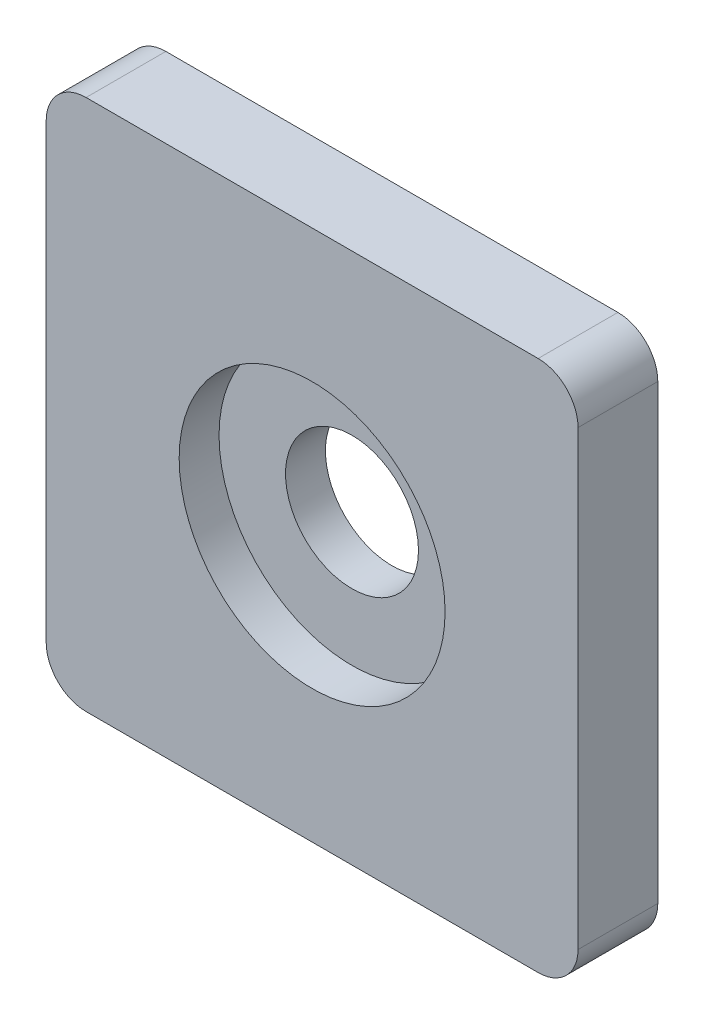
ISO-10303-21;
HEADER;
FILE_DESCRIPTION(('STEP AP214'),'2;1');
FILE_NAME('part.step','',(''),(''),'','','');
FILE_SCHEMA(('AUTOMOTIVE_DESIGN { 1 0 10303 214 1 1 1 1 }'));
ENDSEC;
DATA;
#1=APPLICATION_CONTEXT('core data for automotive mechanical design processes');
#2=APPLICATION_PROTOCOL_DEFINITION('international standard','automotive_design',2000,#1);
#3=PRODUCT_CONTEXT('',#1,'mechanical');
#4=PRODUCT('Part','Part','',(#3));
#5=PRODUCT_RELATED_PRODUCT_CATEGORY('part','',(#4));
#6=PRODUCT_DEFINITION_FORMATION('','',#4);
#7=PRODUCT_DEFINITION_CONTEXT('part definition',#1,'design');
#8=PRODUCT_DEFINITION('design','',#6,#7);
#9=PRODUCT_DEFINITION_SHAPE('','',#8);
#10=(LENGTH_UNIT() NAMED_UNIT(*) SI_UNIT(.MILLI.,.METRE.));
#11=(NAMED_UNIT(*) PLANE_ANGLE_UNIT() SI_UNIT($,.RADIAN.));
#12=(NAMED_UNIT(*) SI_UNIT($,.STERADIAN.) SOLID_ANGLE_UNIT());
#13=UNCERTAINTY_MEASURE_WITH_UNIT(LENGTH_MEASURE(1.E-05),#10,'distance_accuracy_value','');
#14=(GEOMETRIC_REPRESENTATION_CONTEXT(3) GLOBAL_UNCERTAINTY_ASSIGNED_CONTEXT((#13)) GLOBAL_UNIT_ASSIGNED_CONTEXT((#10,
#11,#12)) REPRESENTATION_CONTEXT('',''));
#15=CARTESIAN_POINT('',(0.,0.,0.));
#16=DIRECTION('',(0.,0.,1.));
#17=DIRECTION('',(1.,0.,0.));
#18=AXIS2_PLACEMENT_3D('',#15,#16,#17);
#19=CARTESIAN_POINT('',(0.,0.,3.));
#20=DIRECTION('',(0.,0.,-1.));
#21=DIRECTION('',(-1.,0.,0.));
#22=AXIS2_PLACEMENT_3D('',#19,#20,#21);
#23=CYLINDRICAL_SURFACE('',#22,2.5);
#24=CARTESIAN_POINT('',(0.,0.,0.));
#25=DIRECTION('',(0.,0.,1.));
#26=DIRECTION('',(1.,0.,0.));
#27=AXIS2_PLACEMENT_3D('',#24,#25,#26);
#28=CIRCLE('',#27,2.5);
#29=CARTESIAN_POINT('',(2.5,0.,0.));
#30=VERTEX_POINT('',#29);
#31=EDGE_CURVE('E140',#30,#30,#28,.T.);
#32=ORIENTED_EDGE('',*,*,#31,.F.);
#33=EDGE_LOOP('',(#32));
#34=FACE_BOUND('',#33,.T.);
#35=CARTESIAN_POINT('',(0.,0.,1.5));
#36=DIRECTION('',(0.,0.,1.));
#37=DIRECTION('',(1.,0.,0.));
#38=AXIS2_PLACEMENT_3D('',#35,#36,#37);
#39=CIRCLE('',#38,2.5);
#40=CARTESIAN_POINT('',(2.5,0.,1.5));
#41=VERTEX_POINT('',#40);
#42=EDGE_CURVE('E137',#41,#41,#39,.T.);
#43=ORIENTED_EDGE('',*,*,#42,.T.);
#44=EDGE_LOOP('',(#43));
#45=FACE_BOUND('',#44,.T.);
#46=ADVANCED_FACE('F35',(#34,#45),#23,.F.);
#47=CARTESIAN_POINT('',(0.,0.,3.));
#48=DIRECTION('',(0.,0.,1.));
#49=DIRECTION('',(1.,0.,0.));
#50=AXIS2_PLACEMENT_3D('',#47,#48,#49);
#51=PLANE('',#50);
#52=CARTESIAN_POINT('',(0.,0.,3.));
#53=DIRECTION('',(0.,0.,1.));
#54=DIRECTION('',(1.,0.,0.));
#55=AXIS2_PLACEMENT_3D('',#52,#53,#54);
#56=CIRCLE('',#55,5.);
#57=CARTESIAN_POINT('',(5.,0.,3.));
#58=VERTEX_POINT('',#57);
#59=EDGE_CURVE('E180',#58,#58,#56,.T.);
#60=ORIENTED_EDGE('',*,*,#59,.F.);
#61=EDGE_LOOP('',(#60));
#62=FACE_BOUND('',#61,.T.);
#63=DIRECTION('',(0.,1.,0.));
#64=VECTOR('',#63,1.);
#65=CARTESIAN_POINT('',(10.,-10.,3.));
#66=LINE('',#65,#64);
#67=CARTESIAN_POINT('',(10.,-8.5,3.));
#68=VERTEX_POINT('',#67);
#69=CARTESIAN_POINT('',(10.,8.5,3.));
#70=VERTEX_POINT('',#69);
#71=EDGE_CURVE('E176',#68,#70,#66,.T.);
#72=ORIENTED_EDGE('',*,*,#71,.T.);
#73=CARTESIAN_POINT('',(8.5,8.5,3.));
#74=DIRECTION('',(0.,0.,1.));
#75=DIRECTION('',(1.,0.,0.));
#76=AXIS2_PLACEMENT_3D('',#73,#74,#75);
#77=CIRCLE('',#76,1.5);
#78=CARTESIAN_POINT('',(8.5,10.,3.));
#79=VERTEX_POINT('',#78);
#80=EDGE_CURVE('E155',#70,#79,#77,.T.);
#81=ORIENTED_EDGE('',*,*,#80,.T.);
#82=DIRECTION('',(-1.,0.,0.));
#83=VECTOR('',#82,1.);
#84=CARTESIAN_POINT('',(10.,10.,3.));
#85=LINE('',#84,#83);
#86=CARTESIAN_POINT('',(-8.5,9.99999999999999,3.));
#87=VERTEX_POINT('',#86);
#88=EDGE_CURVE('E121',#79,#87,#85,.T.);
#89=ORIENTED_EDGE('',*,*,#88,.T.);
#90=CARTESIAN_POINT('',(-8.5,8.49999999999999,3.));
#91=DIRECTION('',(0.,0.,1.));
#92=DIRECTION('',(1.,0.,0.));
#93=AXIS2_PLACEMENT_3D('',#90,#91,#92);
#94=CIRCLE('',#93,1.5);
#95=CARTESIAN_POINT('',(-10.,8.49999999999999,3.));
#96=VERTEX_POINT('',#95);
#97=EDGE_CURVE('E150',#87,#96,#94,.T.);
#98=ORIENTED_EDGE('',*,*,#97,.T.);
#99=DIRECTION('',(0.,-1.,0.));
#100=VECTOR('',#99,1.);
#101=CARTESIAN_POINT('',(-10.,-10.,3.));
#102=LINE('',#101,#100);
#103=CARTESIAN_POINT('',(-10.,-8.5,3.));
#104=VERTEX_POINT('',#103);
#105=EDGE_CURVE('E128',#96,#104,#102,.T.);
#106=ORIENTED_EDGE('',*,*,#105,.T.);
#107=CARTESIAN_POINT('',(-8.5,-8.5,3.));
#108=DIRECTION('',(0.,0.,1.));
#109=DIRECTION('',(1.,0.,0.));
#110=AXIS2_PLACEMENT_3D('',#107,#108,#109);
#111=CIRCLE('',#110,1.5);
#112=CARTESIAN_POINT('',(-8.5,-10.,3.));
#113=VERTEX_POINT('',#112);
#114=EDGE_CURVE('E57',#104,#113,#111,.T.);
#115=ORIENTED_EDGE('',*,*,#114,.T.);
#116=DIRECTION('',(1.,0.,0.));
#117=VECTOR('',#116,1.);
#118=CARTESIAN_POINT('',(10.,-10.,3.));
#119=LINE('',#118,#117);
#120=CARTESIAN_POINT('',(8.5,-10.,3.));
#121=VERTEX_POINT('',#120);
#122=EDGE_CURVE('E131',#113,#121,#119,.T.);
#123=ORIENTED_EDGE('',*,*,#122,.T.);
#124=CARTESIAN_POINT('',(8.5,-8.5,3.));
#125=DIRECTION('',(0.,0.,1.));
#126=DIRECTION('',(1.,0.,0.));
#127=AXIS2_PLACEMENT_3D('',#124,#125,#126);
#128=CIRCLE('',#127,1.5);
#129=EDGE_CURVE('E153',#121,#68,#128,.T.);
#130=ORIENTED_EDGE('',*,*,#129,.T.);
#131=EDGE_LOOP('',(#72,#81,#89,#98,#106,#115,#123,#130));
#132=FACE_BOUND('',#131,.T.);
#133=ADVANCED_FACE('F194',(#62,#132),#51,.T.);
#134=CARTESIAN_POINT('',(0.,0.,0.));
#135=DIRECTION('',(0.,0.,1.));
#136=DIRECTION('',(1.,0.,0.));
#137=AXIS2_PLACEMENT_3D('',#134,#135,#136);
#138=PLANE('',#137);
#139=DIRECTION('',(-1.,0.,0.));
#140=VECTOR('',#139,1.);
#141=CARTESIAN_POINT('',(10.,10.,0.));
#142=LINE('',#141,#140);
#143=CARTESIAN_POINT('',(8.5,10.,0.));
#144=VERTEX_POINT('',#143);
#145=CARTESIAN_POINT('',(-8.5,9.99999999999999,0.));
#146=VERTEX_POINT('',#145);
#147=EDGE_CURVE('E118',#144,#146,#142,.T.);
#148=ORIENTED_EDGE('',*,*,#147,.F.);
#149=CARTESIAN_POINT('',(8.5,8.5,0.));
#150=DIRECTION('',(0.,0.,1.));
#151=DIRECTION('',(1.,0.,0.));
#152=AXIS2_PLACEMENT_3D('',#149,#150,#151);
#153=CIRCLE('',#152,1.5);
#154=CARTESIAN_POINT('',(10.,8.5,0.));
#155=VERTEX_POINT('',#154);
#156=EDGE_CURVE('E101',#144,#155,#153,.F.);
#157=ORIENTED_EDGE('',*,*,#156,.T.);
#158=DIRECTION('',(0.,1.,0.));
#159=VECTOR('',#158,1.);
#160=CARTESIAN_POINT('',(10.,-10.,0.));
#161=LINE('',#160,#159);
#162=CARTESIAN_POINT('',(10.,-8.5,0.));
#163=VERTEX_POINT('',#162);
#164=EDGE_CURVE('E129',#163,#155,#161,.T.);
#165=ORIENTED_EDGE('',*,*,#164,.F.);
#166=CARTESIAN_POINT('',(8.5,-8.5,0.));
#167=DIRECTION('',(0.,0.,1.));
#168=DIRECTION('',(1.,0.,0.));
#169=AXIS2_PLACEMENT_3D('',#166,#167,#168);
#170=CIRCLE('',#169,1.5);
#171=CARTESIAN_POINT('',(8.5,-10.,0.));
#172=VERTEX_POINT('',#171);
#173=EDGE_CURVE('E112',#163,#172,#170,.F.);
#174=ORIENTED_EDGE('',*,*,#173,.T.);
#175=DIRECTION('',(1.,0.,0.));
#176=VECTOR('',#175,1.);
#177=CARTESIAN_POINT('',(10.,-10.,0.));
#178=LINE('',#177,#176);
#179=CARTESIAN_POINT('',(-8.5,-10.,0.));
#180=VERTEX_POINT('',#179);
#181=EDGE_CURVE('E133',#180,#172,#178,.T.);
#182=ORIENTED_EDGE('',*,*,#181,.F.);
#183=CARTESIAN_POINT('',(-8.5,-8.5,0.));
#184=DIRECTION('',(0.,0.,1.));
#185=DIRECTION('',(1.,0.,0.));
#186=AXIS2_PLACEMENT_3D('',#183,#184,#185);
#187=CIRCLE('',#186,1.5);
#188=CARTESIAN_POINT('',(-10.,-8.5,0.));
#189=VERTEX_POINT('',#188);
#190=EDGE_CURVE('E144',#180,#189,#187,.F.);
#191=ORIENTED_EDGE('',*,*,#190,.T.);
#192=DIRECTION('',(0.,-1.,0.));
#193=VECTOR('',#192,1.);
#194=CARTESIAN_POINT('',(-10.,-10.,0.));
#195=LINE('',#194,#193);
#196=CARTESIAN_POINT('',(-10.,8.49999999999999,0.));
#197=VERTEX_POINT('',#196);
#198=EDGE_CURVE('E166',#197,#189,#195,.T.);
#199=ORIENTED_EDGE('',*,*,#198,.F.);
#200=CARTESIAN_POINT('',(-8.5,8.49999999999999,0.));
#201=DIRECTION('',(0.,0.,1.));
#202=DIRECTION('',(1.,0.,0.));
#203=AXIS2_PLACEMENT_3D('',#200,#201,#202);
#204=CIRCLE('',#203,1.5);
#205=EDGE_CURVE('E122',#197,#146,#204,.F.);
#206=ORIENTED_EDGE('',*,*,#205,.T.);
#207=EDGE_LOOP('',(#148,#157,#165,#174,#182,#191,#199,#206));
#208=FACE_BOUND('',#207,.T.);
#209=ORIENTED_EDGE('',*,*,#31,.T.);
#210=EDGE_LOOP('',(#209));
#211=FACE_BOUND('',#210,.T.);
#212=ADVANCED_FACE('F125',(#208,#211),#138,.F.);
#213=CARTESIAN_POINT('',(-10.,-10.,3.));
#214=DIRECTION('',(1.,0.,0.));
#215=DIRECTION('',(0.,0.,-1.));
#216=AXIS2_PLACEMENT_3D('',#213,#214,#215);
#217=PLANE('',#216);
#218=ORIENTED_EDGE('',*,*,#198,.T.);
#219=DIRECTION('',(0.,0.,-1.));
#220=VECTOR('',#219,1.);
#221=CARTESIAN_POINT('',(-10.,-8.5,3.));
#222=LINE('',#221,#220);
#223=EDGE_CURVE('E11',#189,#104,#222,.F.);
#224=ORIENTED_EDGE('',*,*,#223,.T.);
#225=ORIENTED_EDGE('',*,*,#105,.F.);
#226=DIRECTION('',(0.,0.,-1.));
#227=VECTOR('',#226,1.);
#228=CARTESIAN_POINT('',(-10.,8.49999999999999,3.));
#229=LINE('',#228,#227);
#230=EDGE_CURVE('E43',#96,#197,#229,.T.);
#231=ORIENTED_EDGE('',*,*,#230,.T.);
#232=EDGE_LOOP('',(#218,#224,#225,#231));
#233=FACE_BOUND('',#232,.T.);
#234=ADVANCED_FACE('F165',(#233),#217,.F.);
#235=CARTESIAN_POINT('',(10.,-10.,3.));
#236=DIRECTION('',(0.,1.,0.));
#237=DIRECTION('',(-1.,0.,0.));
#238=AXIS2_PLACEMENT_3D('',#235,#236,#237);
#239=PLANE('',#238);
#240=ORIENTED_EDGE('',*,*,#181,.T.);
#241=DIRECTION('',(0.,0.,-1.));
#242=VECTOR('',#241,1.);
#243=CARTESIAN_POINT('',(8.5,-10.,3.));
#244=LINE('',#243,#242);
#245=EDGE_CURVE('E50',#172,#121,#244,.F.);
#246=ORIENTED_EDGE('',*,*,#245,.T.);
#247=ORIENTED_EDGE('',*,*,#122,.F.);
#248=DIRECTION('',(0.,0.,-1.));
#249=VECTOR('',#248,1.);
#250=CARTESIAN_POINT('',(-8.5,-10.,3.));
#251=LINE('',#250,#249);
#252=EDGE_CURVE('E157',#113,#180,#251,.T.);
#253=ORIENTED_EDGE('',*,*,#252,.T.);
#254=EDGE_LOOP('',(#240,#246,#247,#253));
#255=FACE_BOUND('',#254,.T.);
#256=ADVANCED_FACE('F204',(#255),#239,.F.);
#257=CARTESIAN_POINT('',(10.,-10.,3.));
#258=DIRECTION('',(-1.,0.,0.));
#259=DIRECTION('',(0.,0.,1.));
#260=AXIS2_PLACEMENT_3D('',#257,#258,#259);
#261=PLANE('',#260);
#262=ORIENTED_EDGE('',*,*,#164,.T.);
#263=DIRECTION('',(0.,0.,-1.));
#264=VECTOR('',#263,1.);
#265=CARTESIAN_POINT('',(10.,8.5,3.));
#266=LINE('',#265,#264);
#267=EDGE_CURVE('E106',#155,#70,#266,.F.);
#268=ORIENTED_EDGE('',*,*,#267,.T.);
#269=ORIENTED_EDGE('',*,*,#71,.F.);
#270=DIRECTION('',(0.,0.,-1.));
#271=VECTOR('',#270,1.);
#272=CARTESIAN_POINT('',(10.,-8.5,3.));
#273=LINE('',#272,#271);
#274=EDGE_CURVE('E111',#68,#163,#273,.T.);
#275=ORIENTED_EDGE('',*,*,#274,.T.);
#276=EDGE_LOOP('',(#262,#268,#269,#275));
#277=FACE_BOUND('',#276,.T.);
#278=ADVANCED_FACE('F201',(#277),#261,.F.);
#279=CARTESIAN_POINT('',(10.,10.,3.));
#280=DIRECTION('',(0.,-1.,0.));
#281=DIRECTION('',(1.,0.,0.));
#282=AXIS2_PLACEMENT_3D('',#279,#280,#281);
#283=PLANE('',#282);
#284=ORIENTED_EDGE('',*,*,#88,.F.);
#285=DIRECTION('',(0.,0.,-1.));
#286=VECTOR('',#285,1.);
#287=CARTESIAN_POINT('',(8.5,10.,3.));
#288=LINE('',#287,#286);
#289=EDGE_CURVE('E105',#79,#144,#288,.T.);
#290=ORIENTED_EDGE('',*,*,#289,.T.);
#291=ORIENTED_EDGE('',*,*,#147,.T.);
#292=DIRECTION('',(0.,0.,-1.));
#293=VECTOR('',#292,1.);
#294=CARTESIAN_POINT('',(-8.5,9.99999999999999,3.));
#295=LINE('',#294,#293);
#296=EDGE_CURVE('E123',#146,#87,#295,.F.);
#297=ORIENTED_EDGE('',*,*,#296,.T.);
#298=EDGE_LOOP('',(#284,#290,#291,#297));
#299=FACE_BOUND('',#298,.T.);
#300=ADVANCED_FACE('F117',(#299),#283,.F.);
#301=CARTESIAN_POINT('',(0.,0.,1.5));
#302=DIRECTION('',(0.,0.,1.));
#303=DIRECTION('',(1.,0.,0.));
#304=AXIS2_PLACEMENT_3D('',#301,#302,#303);
#305=CYLINDRICAL_SURFACE('',#304,5.);
#306=CARTESIAN_POINT('',(0.,0.,1.5));
#307=DIRECTION('',(0.,0.,1.));
#308=DIRECTION('',(1.,0.,0.));
#309=AXIS2_PLACEMENT_3D('',#306,#307,#308);
#310=CIRCLE('',#309,5.);
#311=CARTESIAN_POINT('',(5.,0.,1.5));
#312=VERTEX_POINT('',#311);
#313=EDGE_CURVE('E141',#312,#312,#310,.T.);
#314=ORIENTED_EDGE('',*,*,#313,.F.);
#315=EDGE_LOOP('',(#314));
#316=FACE_BOUND('',#315,.T.);
#317=ORIENTED_EDGE('',*,*,#59,.T.);
#318=EDGE_LOOP('',(#317));
#319=FACE_BOUND('',#318,.T.);
#320=ADVANCED_FACE('F188',(#316,#319),#305,.F.);
#321=CARTESIAN_POINT('',(0.,0.,1.5));
#322=DIRECTION('',(0.,0.,1.));
#323=DIRECTION('',(1.,0.,0.));
#324=AXIS2_PLACEMENT_3D('',#321,#322,#323);
#325=PLANE('',#324);
#326=ORIENTED_EDGE('',*,*,#42,.F.);
#327=EDGE_LOOP('',(#326));
#328=FACE_BOUND('',#327,.T.);
#329=ORIENTED_EDGE('',*,*,#313,.T.);
#330=EDGE_LOOP('',(#329));
#331=FACE_BOUND('',#330,.T.);
#332=ADVANCED_FACE('F186',(#328,#331),#325,.T.);
#333=CARTESIAN_POINT('',(8.5,8.5,3.));
#334=DIRECTION('',(0.,0.,-1.));
#335=DIRECTION('',(-1.,0.,0.));
#336=AXIS2_PLACEMENT_3D('',#333,#334,#335);
#337=CYLINDRICAL_SURFACE('',#336,1.5);
#338=ORIENTED_EDGE('',*,*,#80,.F.);
#339=ORIENTED_EDGE('',*,*,#267,.F.);
#340=ORIENTED_EDGE('',*,*,#156,.F.);
#341=ORIENTED_EDGE('',*,*,#289,.F.);
#342=EDGE_LOOP('',(#338,#339,#340,#341));
#343=FACE_BOUND('',#342,.T.);
#344=ADVANCED_FACE('F104',(#343),#337,.T.);
#345=CARTESIAN_POINT('',(8.5,-8.5,3.));
#346=DIRECTION('',(0.,0.,-1.));
#347=DIRECTION('',(-1.,0.,0.));
#348=AXIS2_PLACEMENT_3D('',#345,#346,#347);
#349=CYLINDRICAL_SURFACE('',#348,1.5);
#350=ORIENTED_EDGE('',*,*,#129,.F.);
#351=ORIENTED_EDGE('',*,*,#245,.F.);
#352=ORIENTED_EDGE('',*,*,#173,.F.);
#353=ORIENTED_EDGE('',*,*,#274,.F.);
#354=EDGE_LOOP('',(#350,#351,#352,#353));
#355=FACE_BOUND('',#354,.T.);
#356=ADVANCED_FACE('F203',(#355),#349,.T.);
#357=CARTESIAN_POINT('',(-8.5,-8.5,3.));
#358=DIRECTION('',(0.,0.,-1.));
#359=DIRECTION('',(-1.,0.,0.));
#360=AXIS2_PLACEMENT_3D('',#357,#358,#359);
#361=CYLINDRICAL_SURFACE('',#360,1.5);
#362=ORIENTED_EDGE('',*,*,#114,.F.);
#363=ORIENTED_EDGE('',*,*,#223,.F.);
#364=ORIENTED_EDGE('',*,*,#190,.F.);
#365=ORIENTED_EDGE('',*,*,#252,.F.);
#366=EDGE_LOOP('',(#362,#363,#364,#365));
#367=FACE_BOUND('',#366,.T.);
#368=ADVANCED_FACE('F207',(#367),#361,.T.);
#369=CARTESIAN_POINT('',(-8.5,8.49999999999999,3.));
#370=DIRECTION('',(0.,0.,-1.));
#371=DIRECTION('',(-1.,0.,0.));
#372=AXIS2_PLACEMENT_3D('',#369,#370,#371);
#373=CYLINDRICAL_SURFACE('',#372,1.5);
#374=ORIENTED_EDGE('',*,*,#97,.F.);
#375=ORIENTED_EDGE('',*,*,#296,.F.);
#376=ORIENTED_EDGE('',*,*,#205,.F.);
#377=ORIENTED_EDGE('',*,*,#230,.F.);
#378=EDGE_LOOP('',(#374,#375,#376,#377));
#379=FACE_BOUND('',#378,.T.);
#380=ADVANCED_FACE('F37',(#379),#373,.T.);
#381=CLOSED_SHELL('',(#46,#133,#212,#234,#256,#278,#300,#320,#332,#344,#356,#368,#380));
#382=MANIFOLD_SOLID_BREP('B2',#381);
#383=ADVANCED_BREP_SHAPE_REPRESENTATION('',(#18,#382),#14);
#384=SHAPE_DEFINITION_REPRESENTATION(#9,#383);
ENDSEC;
END-ISO-10303-21;
